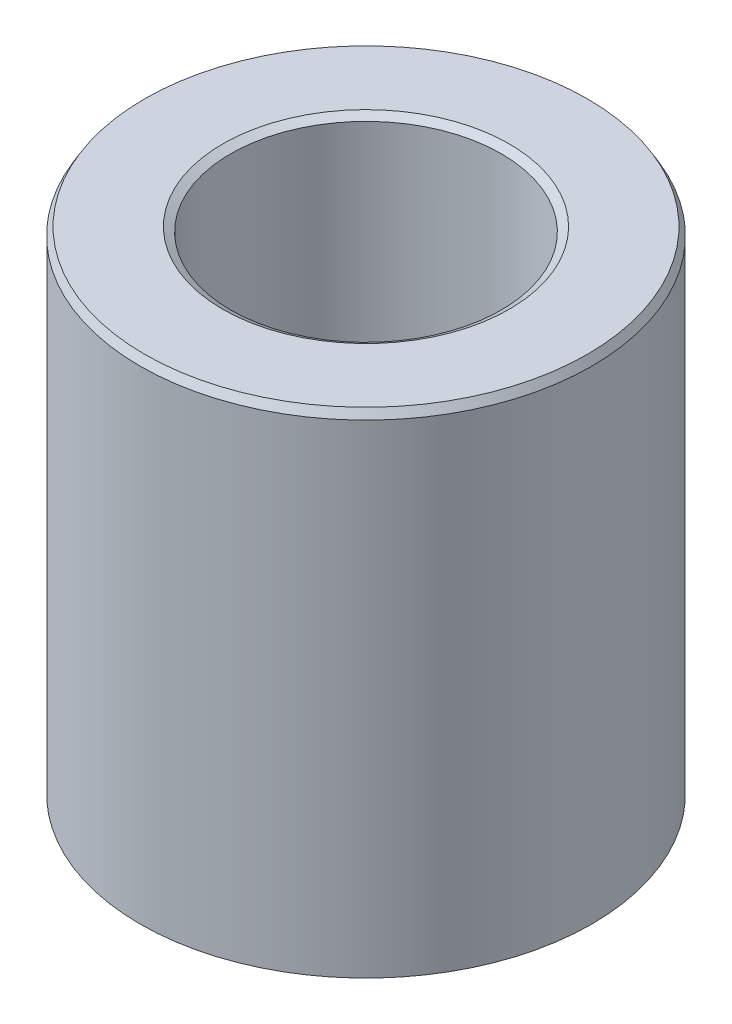
ISO-10303-21;
HEADER;
FILE_DESCRIPTION(('STEP AP214'),'2;1');
FILE_NAME('part.step','',(''),(''),'','','');
FILE_SCHEMA(('AUTOMOTIVE_DESIGN { 1 0 10303 214 1 1 1 1 }'));
ENDSEC;
DATA;
#1=APPLICATION_CONTEXT('core data for automotive mechanical design processes');
#2=APPLICATION_PROTOCOL_DEFINITION('international standard','automotive_design',2000,#1);
#3=PRODUCT_CONTEXT('',#1,'mechanical');
#4=PRODUCT('Part','Part','',(#3));
#5=PRODUCT_RELATED_PRODUCT_CATEGORY('part','',(#4));
#6=PRODUCT_DEFINITION_FORMATION('','',#4);
#7=PRODUCT_DEFINITION_CONTEXT('part definition',#1,'design');
#8=PRODUCT_DEFINITION('design','',#6,#7);
#9=PRODUCT_DEFINITION_SHAPE('','',#8);
#10=(LENGTH_UNIT() NAMED_UNIT(*) SI_UNIT(.MILLI.,.METRE.));
#11=(NAMED_UNIT(*) PLANE_ANGLE_UNIT() SI_UNIT($,.RADIAN.));
#12=(NAMED_UNIT(*) SI_UNIT($,.STERADIAN.) SOLID_ANGLE_UNIT());
#13=UNCERTAINTY_MEASURE_WITH_UNIT(LENGTH_MEASURE(1.E-05),#10,'distance_accuracy_value','');
#14=(GEOMETRIC_REPRESENTATION_CONTEXT(3) GLOBAL_UNCERTAINTY_ASSIGNED_CONTEXT((#13)) GLOBAL_UNIT_ASSIGNED_CONTEXT((#10,
#11,#12)) REPRESENTATION_CONTEXT('',''));
#15=CARTESIAN_POINT('',(0.,0.,0.));
#16=DIRECTION('',(0.,0.,1.));
#17=DIRECTION('',(1.,0.,0.));
#18=AXIS2_PLACEMENT_3D('',#15,#16,#17);
#19=CARTESIAN_POINT('',(0.,120.694779405563,0.));
#20=DIRECTION('',(0.,-1.,0.));
#21=DIRECTION('',(0.,0.,-1.));
#22=AXIS2_PLACEMENT_3D('',#19,#20,#21);
#23=CYLINDRICAL_SURFACE('',#22,55.);
#24=CARTESIAN_POINT('',(0.,1.11331779506904,0.));
#25=DIRECTION('',(0.,1.,0.));
#26=DIRECTION('',(0.,0.,1.));
#27=AXIS2_PLACEMENT_3D('',#24,#25,#26);
#28=CIRCLE('',#27,55.);
#29=CARTESIAN_POINT('',(0.,1.11331779506903,-55.));
#30=VERTEX_POINT('',#29);
#31=EDGE_CURVE('E10',#30,#30,#28,.T.);
#32=CARTESIAN_POINT('',(0.,118.766456419533,0.));
#33=DIRECTION('',(0.,1.,0.));
#34=DIRECTION('',(0.,0.,1.));
#35=AXIS2_PLACEMENT_3D('',#32,#33,#34);
#36=CIRCLE('',#35,55.);
#37=CARTESIAN_POINT('',(0.,118.766456419533,-55.));
#38=VERTEX_POINT('',#37);
#39=EDGE_CURVE('E50',#38,#38,#36,.F.);
#40=CARTESIAN_POINT('',(0.,1.11331779506903,-55.));
#41=CARTESIAN_POINT('',(0.,2.3388713224072,-55.));
#42=CARTESIAN_POINT('',(0.,3.56442484974537,-55.));
#43=CARTESIAN_POINT('',(0.,6.01553190442171,-55.));
#44=CARTESIAN_POINT('',(0.,7.24108543175988,-55.));
#45=CARTESIAN_POINT('',(0.,9.69219248643622,-55.));
#46=CARTESIAN_POINT('',(0.,10.9177460137744,-55.));
#47=CARTESIAN_POINT('',(0.,13.3688530684507,-55.));
#48=CARTESIAN_POINT('',(0.,14.5944065957889,-55.));
#49=CARTESIAN_POINT('',(0.,17.0455136504653,-55.));
#50=CARTESIAN_POINT('',(0.,18.2710671778034,-55.));
#51=CARTESIAN_POINT('',(0.,20.7221742324798,-55.));
#52=CARTESIAN_POINT('',(0.,21.9477277598179,-55.));
#53=CARTESIAN_POINT('',(0.,24.3988348144943,-55.));
#54=CARTESIAN_POINT('',(0.,25.6243883418325,-55.));
#55=CARTESIAN_POINT('',(0.,28.0754953965088,-55.));
#56=CARTESIAN_POINT('',(0.,29.301048923847,-55.));
#57=CARTESIAN_POINT('',(0.,31.7521559785233,-55.));
#58=CARTESIAN_POINT('',(0.,32.9777095058615,-55.));
#59=CARTESIAN_POINT('',(0.,35.4288165605378,-55.));
#60=CARTESIAN_POINT('',(0.,36.654370087876,-55.));
#61=CARTESIAN_POINT('',(0.,39.1054771425523,-55.));
#62=CARTESIAN_POINT('',(0.,40.3310306698905,-55.));
#63=CARTESIAN_POINT('',(0.,42.7821377245668,-55.));
#64=CARTESIAN_POINT('',(0.,44.007691251905,-55.));
#65=CARTESIAN_POINT('',(0.,46.4587983065814,-55.));
#66=CARTESIAN_POINT('',(0.,47.6843518339195,-55.));
#67=CARTESIAN_POINT('',(0.,50.1354588885959,-55.));
#68=CARTESIAN_POINT('',(0.,51.3610124159341,-55.));
#69=CARTESIAN_POINT('',(0.,53.8121194706104,-55.));
#70=CARTESIAN_POINT('',(0.,55.0376729979486,-55.));
#71=CARTESIAN_POINT('',(0.,57.4887800526249,-55.));
#72=CARTESIAN_POINT('',(0.,58.7143335799631,-55.));
#73=CARTESIAN_POINT('',(0.,61.1654406346394,-55.));
#74=CARTESIAN_POINT('',(0.,62.3909941619776,-55.));
#75=CARTESIAN_POINT('',(0.,64.8421012166539,-55.));
#76=CARTESIAN_POINT('',(0.,66.0676547439921,-55.));
#77=CARTESIAN_POINT('',(0.,68.5187617986684,-55.));
#78=CARTESIAN_POINT('',(0.,69.7443153260066,-55.));
#79=CARTESIAN_POINT('',(0.,72.195422380683,-55.));
#80=CARTESIAN_POINT('',(0.,73.4209759080211,-55.));
#81=CARTESIAN_POINT('',(0.,75.8720829626975,-55.));
#82=CARTESIAN_POINT('',(0.,77.0976364900356,-55.));
#83=CARTESIAN_POINT('',(0.,79.548743544712,-55.));
#84=CARTESIAN_POINT('',(0.,80.7742970720501,-55.));
#85=CARTESIAN_POINT('',(0.,83.2254041267265,-55.));
#86=CARTESIAN_POINT('',(0.,84.4509576540647,-55.));
#87=CARTESIAN_POINT('',(0.,86.902064708741,-55.));
#88=CARTESIAN_POINT('',(0.,88.1276182360792,-55.));
#89=CARTESIAN_POINT('',(0.,90.5787252907555,-55.));
#90=CARTESIAN_POINT('',(0.,91.8042788180937,-55.));
#91=CARTESIAN_POINT('',(0.,94.25538587277,-55.));
#92=CARTESIAN_POINT('',(0.,95.4809394001082,-55.));
#93=CARTESIAN_POINT('',(0.,97.9320464547846,-55.));
#94=CARTESIAN_POINT('',(0.,99.1575999821227,-55.));
#95=CARTESIAN_POINT('',(0.,101.608707036799,-55.));
#96=CARTESIAN_POINT('',(0.,102.834260564137,-55.));
#97=CARTESIAN_POINT('',(0.,105.285367618814,-55.));
#98=CARTESIAN_POINT('',(0.,106.510921146152,-55.));
#99=CARTESIAN_POINT('',(0.,108.962028200828,-55.));
#100=CARTESIAN_POINT('',(0.,110.187581728166,-55.));
#101=CARTESIAN_POINT('',(0.,112.638688782843,-55.));
#102=CARTESIAN_POINT('',(0.,113.864242310181,-55.));
#103=CARTESIAN_POINT('',(0.,116.315349364857,-55.));
#104=CARTESIAN_POINT('',(0.,117.540902892195,-55.));
#105=CARTESIAN_POINT('',(0.,118.766456419533,-55.));
#106=B_SPLINE_CURVE_WITH_KNOTS('',3,(#40,#41,#42,#43,#44,#45,#46,#47,#48,#49,#50,#51,#52,#53,
#54,#55,#56,#57,#58,#59,#60,#61,#62,#63,#64,#65,#66,#67,#68,#69,#70,#71,#72,#73,#74,#75,#76,#77,
#78,#79,#80,#81,#82,#83,#84,#85,#86,#87,#88,#89,#90,#91,#92,#93,#94,#95,#96,#97,#98,#99,#100,
#101,#102,#103,#104,#105),.UNSPECIFIED.,.F.,.F.,(4,2,2,2,2,2,2,2,2,2,2,2,2,2,2,2,2,2,2,2,2,2,2,
2,2,2,2,2,2,2,2,2,4),(0.,3.67666058201452,7.35332116402902,11.0299817460435,14.7066423280581,
18.3833029100726,22.0599634920871,25.7366240741016,29.4132846561161,33.0899452381306,
36.7666058201451,40.4432664021596,44.1199269841742,47.7965875661887,51.4732481482032,
55.1499087302177,58.8265693122322,62.5032298942467,66.1798904762612,69.8565510582757,
73.5332116402903,77.2098722223048,80.8865328043193,84.5631933863338,88.2398539683483,
91.9165145503628,95.5931751323774,99.2698357143919,102.946496296406,106.623156878421,
110.299817460435,113.97647804245,117.653138624464),.UNSPECIFIED.);
#107=EDGE_CURVE('BSEAM39',#30,#38,#106,.T.);
#108=ORIENTED_EDGE('',*,*,#31,.T.);
#109=ORIENTED_EDGE('',*,*,#39,.T.);
#110=ORIENTED_EDGE('',*,*,#107,.T.);
#111=ORIENTED_EDGE('',*,*,#107,.F.);
#112=EDGE_LOOP('',(#108,#110,#109,#111));
#113=FACE_BOUND('',#112,.T.);
#114=ADVANCED_FACE('F39',(#113),#23,.T.);
#115=CARTESIAN_POINT('',(0.,120.694779405563,0.));
#116=DIRECTION('',(0.,1.,0.));
#117=DIRECTION('',(0.,0.,1.));
#118=AXIS2_PLACEMENT_3D('',#115,#116,#117);
#119=PLANE('',#118);
#120=CARTESIAN_POINT('',(0.,120.694779405563,0.));
#121=DIRECTION('',(0.,1.,0.));
#122=DIRECTION('',(0.,0.,1.));
#123=AXIS2_PLACEMENT_3D('',#120,#121,#122);
#124=CIRCLE('',#123,34.8838732371338);
#125=CARTESIAN_POINT('',(0.,120.694779405563,34.8838732371338));
#126=VERTEX_POINT('',#125);
#127=EDGE_CURVE('E58',#126,#126,#124,.F.);
#128=ORIENTED_EDGE('',*,*,#127,.T.);
#129=EDGE_LOOP('',(#128));
#130=FACE_BOUND('',#129,.T.);
#131=CARTESIAN_POINT('',(0.,120.694779405563,0.));
#132=DIRECTION('',(0.,1.,0.));
#133=DIRECTION('',(0.,0.,1.));
#134=AXIS2_PLACEMENT_3D('',#131,#132,#133);
#135=CIRCLE('',#134,53.8866822049311);
#136=CARTESIAN_POINT('',(0.,120.694779405563,53.8866822049311));
#137=VERTEX_POINT('',#136);
#138=EDGE_CURVE('E61',#137,#137,#135,.T.);
#139=ORIENTED_EDGE('',*,*,#138,.T.);
#140=EDGE_LOOP('',(#139));
#141=FACE_BOUND('',#140,.T.);
#142=ADVANCED_FACE('F88',(#130,#141),#119,.T.);
#143=CARTESIAN_POINT('',(0.,0.,0.));
#144=DIRECTION('',(0.,1.,0.));
#145=DIRECTION('',(0.,0.,1.));
#146=AXIS2_PLACEMENT_3D('',#143,#144,#145);
#147=PLANE('',#146);
#148=CARTESIAN_POINT('',(0.,0.,0.));
#149=DIRECTION('',(0.,1.,0.));
#150=DIRECTION('',(0.,0.,1.));
#151=AXIS2_PLACEMENT_3D('',#148,#149,#150);
#152=CIRCLE('',#151,34.0688680461726);
#153=CARTESIAN_POINT('',(0.,0.,34.0688680461726));
#154=VERTEX_POINT('',#153);
#155=EDGE_CURVE('E51',#154,#154,#152,.T.);
#156=ORIENTED_EDGE('',*,*,#155,.T.);
#157=EDGE_LOOP('',(#156));
#158=FACE_BOUND('',#157,.T.);
#159=CARTESIAN_POINT('',(0.,0.,0.));
#160=DIRECTION('',(0.,1.,0.));
#161=DIRECTION('',(0.,0.,1.));
#162=AXIS2_PLACEMENT_3D('',#159,#160,#161);
#163=CIRCLE('',#162,53.0716770139698);
#164=CARTESIAN_POINT('',(0.,0.,53.0716770139698));
#165=VERTEX_POINT('',#164);
#166=EDGE_CURVE('E54',#165,#165,#163,.F.);
#167=ORIENTED_EDGE('',*,*,#166,.T.);
#168=EDGE_LOOP('',(#167));
#169=FACE_BOUND('',#168,.T.);
#170=ADVANCED_FACE('F83',(#158,#169),#147,.F.);
#171=CARTESIAN_POINT('',(0.,120.694779405563,0.));
#172=DIRECTION('',(0.,-1.,0.));
#173=DIRECTION('',(0.,0.,-1.));
#174=AXIS2_PLACEMENT_3D('',#171,#172,#173);
#175=CYLINDRICAL_SURFACE('',#174,32.9555502511036);
#176=CARTESIAN_POINT('',(0.,119.581461610494,0.));
#177=DIRECTION('',(0.,1.,0.));
#178=DIRECTION('',(0.,0.,1.));
#179=AXIS2_PLACEMENT_3D('',#176,#177,#178);
#180=CIRCLE('',#179,32.9555502511036);
#181=CARTESIAN_POINT('',(0.,119.581461610494,-32.9555502511036));
#182=VERTEX_POINT('',#181);
#183=EDGE_CURVE('E67',#182,#182,#180,.T.);
#184=CARTESIAN_POINT('',(0.,1.92832298603005,0.));
#185=DIRECTION('',(0.,1.,0.));
#186=DIRECTION('',(0.,0.,1.));
#187=AXIS2_PLACEMENT_3D('',#184,#185,#186);
#188=CIRCLE('',#187,32.9555502511036);
#189=CARTESIAN_POINT('',(0.,1.92832298603003,-32.9555502511036));
#190=VERTEX_POINT('',#189);
#191=EDGE_CURVE('E69',#190,#190,#188,.F.);
#192=CARTESIAN_POINT('',(0.,119.581461610494,-32.9555502511036));
#193=CARTESIAN_POINT('',(0.,118.355908083156,-32.9555502511036));
#194=CARTESIAN_POINT('',(0.,117.130354555818,-32.9555502511036));
#195=CARTESIAN_POINT('',(0.,114.679247501142,-32.9555502511036));
#196=CARTESIAN_POINT('',(0.,113.453693973803,-32.9555502511036));
#197=CARTESIAN_POINT('',(0.,111.002586919127,-32.9555502511036));
#198=CARTESIAN_POINT('',(0.,109.777033391789,-32.9555502511036));
#199=CARTESIAN_POINT('',(0.,107.325926337113,-32.9555502511036));
#200=CARTESIAN_POINT('',(0.,106.100372809774,-32.9555502511036));
#201=CARTESIAN_POINT('',(0.,103.649265755098,-32.9555502511036));
#202=CARTESIAN_POINT('',(0.,102.42371222776,-32.9555502511036));
#203=CARTESIAN_POINT('',(0.,99.9726051730836,-32.9555502511036));
#204=CARTESIAN_POINT('',(0.,98.7470516457454,-32.9555502511036));
#205=CARTESIAN_POINT('',(0.,96.2959445910691,-32.9555502511036));
#206=CARTESIAN_POINT('',(0.,95.0703910637309,-32.9555502511036));
#207=CARTESIAN_POINT('',(0.,92.6192840090546,-32.9555502511036));
#208=CARTESIAN_POINT('',(0.,91.3937304817164,-32.9555502511036));
#209=CARTESIAN_POINT('',(0.,88.9426234270401,-32.9555502511036));
#210=CARTESIAN_POINT('',(0.,87.7170698997019,-32.9555502511036));
#211=CARTESIAN_POINT('',(0.,85.2659628450256,-32.9555502511036));
#212=CARTESIAN_POINT('',(0.,84.0404093176874,-32.9555502511036));
#213=CARTESIAN_POINT('',(0.,81.5893022630111,-32.9555502511036));
#214=CARTESIAN_POINT('',(0.,80.3637487356729,-32.9555502511036));
#215=CARTESIAN_POINT('',(0.,77.9126416809966,-32.9555502511036));
#216=CARTESIAN_POINT('',(0.,76.6870881536584,-32.9555502511036));
#217=CARTESIAN_POINT('',(0.,74.235981098982,-32.9555502511036));
#218=CARTESIAN_POINT('',(0.,73.0104275716439,-32.9555502511036));
#219=CARTESIAN_POINT('',(0.,70.5593205169675,-32.9555502511036));
#220=CARTESIAN_POINT('',(0.,69.3337669896294,-32.9555502511036));
#221=CARTESIAN_POINT('',(0.,66.882659934953,-32.9555502511036));
#222=CARTESIAN_POINT('',(0.,65.6571064076148,-32.9555502511036));
#223=CARTESIAN_POINT('',(0.,63.2059993529385,-32.9555502511036));
#224=CARTESIAN_POINT('',(0.,61.9804458256003,-32.9555502511036));
#225=CARTESIAN_POINT('',(0.,59.529338770924,-32.9555502511036));
#226=CARTESIAN_POINT('',(0.,58.3037852435858,-32.9555502511036));
#227=CARTESIAN_POINT('',(0.,55.8526781889095,-32.9555502511036));
#228=CARTESIAN_POINT('',(0.,54.6271246615713,-32.9555502511036));
#229=CARTESIAN_POINT('',(0.,52.176017606895,-32.9555502511036));
#230=CARTESIAN_POINT('',(0.,50.9504640795568,-32.9555502511036));
#231=CARTESIAN_POINT('',(0.,48.4993570248805,-32.9555502511036));
#232=CARTESIAN_POINT('',(0.,47.2738034975423,-32.9555502511036));
#233=CARTESIAN_POINT('',(0.,44.822696442866,-32.9555502511036));
#234=CARTESIAN_POINT('',(0.,43.5971429155278,-32.9555502511036));
#235=CARTESIAN_POINT('',(0.,41.1460358608515,-32.9555502511036));
#236=CARTESIAN_POINT('',(0.,39.9204823335133,-32.9555502511036));
#237=CARTESIAN_POINT('',(0.,37.4693752788369,-32.9555502511036));
#238=CARTESIAN_POINT('',(0.,36.2438217514988,-32.9555502511036));
#239=CARTESIAN_POINT('',(0.,33.7927146968224,-32.9555502511036));
#240=CARTESIAN_POINT('',(0.,32.5671611694843,-32.9555502511036));
#241=CARTESIAN_POINT('',(0.,30.1160541148079,-32.9555502511036));
#242=CARTESIAN_POINT('',(0.,28.8905005874698,-32.9555502511036));
#243=CARTESIAN_POINT('',(0.,26.4393935327934,-32.9555502511036));
#244=CARTESIAN_POINT('',(0.,25.2138400054553,-32.9555502511036));
#245=CARTESIAN_POINT('',(0.,22.7627329507789,-32.9555502511036));
#246=CARTESIAN_POINT('',(0.,21.5371794234407,-32.9555502511036));
#247=CARTESIAN_POINT('',(0.,19.0860723687644,-32.9555502511036));
#248=CARTESIAN_POINT('',(0.,17.8605188414262,-32.9555502511036));
#249=CARTESIAN_POINT('',(0.,15.4094117867499,-32.9555502511036));
#250=CARTESIAN_POINT('',(0.,14.1838582594117,-32.9555502511036));
#251=CARTESIAN_POINT('',(0.,11.7327512047354,-32.9555502511036));
#252=CARTESIAN_POINT('',(0.,10.5071976773972,-32.9555502511036));
#253=CARTESIAN_POINT('',(0.,8.05609062272088,-32.9555502511036));
#254=CARTESIAN_POINT('',(0.,6.83053709538271,-32.9555502511036));
#255=CARTESIAN_POINT('',(0.,4.37943004070637,-32.9555502511036));
#256=CARTESIAN_POINT('',(0.,3.1538765133682,-32.9555502511036));
#257=CARTESIAN_POINT('',(0.,1.92832298603003,-32.9555502511036));
#258=B_SPLINE_CURVE_WITH_KNOTS('',3,(#192,#193,#194,#195,#196,#197,#198,#199,#200,#201,#202,
#203,#204,#205,#206,#207,#208,#209,#210,#211,#212,#213,#214,#215,#216,#217,#218,#219,#220,#221,
#222,#223,#224,#225,#226,#227,#228,#229,#230,#231,#232,#233,#234,#235,#236,#237,#238,#239,#240,
#241,#242,#243,#244,#245,#246,#247,#248,#249,#250,#251,#252,#253,#254,#255,#256,#257),
.UNSPECIFIED.,.F.,.F.,(4,2,2,2,2,2,2,2,2,2,2,2,2,2,2,2,2,2,2,2,2,2,2,2,2,2,2,2,2,2,2,2,4),(0.,
3.6766605820145,7.35332116402901,11.0299817460435,14.706642328058,18.3833029100725,
22.059963492087,25.7366240741016,29.4132846561161,33.0899452381306,36.7666058201451,
40.4432664021596,44.1199269841741,47.7965875661886,51.4732481482031,55.1499087302176,
58.8265693122321,62.5032298942466,66.1798904762611,69.8565510582757,73.5332116402902,
77.2098722223047,80.8865328043192,84.5631933863337,88.2398539683482,91.9165145503627,
95.5931751323772,99.2698357143917,102.946496296406,106.623156878421,110.299817460435,
113.97647804245,117.653138624464),.UNSPECIFIED.);
#259=EDGE_CURVE('BSEAM71',#182,#190,#258,.T.);
#260=ORIENTED_EDGE('',*,*,#183,.T.);
#261=ORIENTED_EDGE('',*,*,#191,.T.);
#262=ORIENTED_EDGE('',*,*,#259,.T.);
#263=ORIENTED_EDGE('',*,*,#259,.F.);
#264=EDGE_LOOP('',(#260,#262,#261,#263));
#265=FACE_BOUND('',#264,.T.);
#266=ADVANCED_FACE('F71',(#265),#175,.F.);
#267=CARTESIAN_POINT('',(0.,119.581461610494,0.));
#268=DIRECTION('',(0.,1.,0.));
#269=DIRECTION('',(0.,0.,1.));
#270=AXIS2_PLACEMENT_3D('',#267,#268,#269);
#271=CONICAL_SURFACE('',#270,32.9555502511036,1.0471975511966);
#272=ORIENTED_EDGE('',*,*,#127,.F.);
#273=EDGE_LOOP('',(#272));
#274=FACE_BOUND('',#273,.T.);
#275=ORIENTED_EDGE('',*,*,#183,.F.);
#276=EDGE_LOOP('',(#275));
#277=FACE_BOUND('',#276,.T.);
#278=ADVANCED_FACE('F77',(#274,#277),#271,.F.);
#279=CARTESIAN_POINT('',(0.,0.,0.));
#280=DIRECTION('',(0.,-1.,0.));
#281=DIRECTION('',(0.,0.,-1.));
#282=AXIS2_PLACEMENT_3D('',#279,#280,#281);
#283=CONICAL_SURFACE('',#282,34.0688680461726,0.523598775598294);
#284=ORIENTED_EDGE('',*,*,#191,.F.);
#285=EDGE_LOOP('',(#284));
#286=FACE_BOUND('',#285,.T.);
#287=ORIENTED_EDGE('',*,*,#155,.F.);
#288=EDGE_LOOP('',(#287));
#289=FACE_BOUND('',#288,.T.);
#290=ADVANCED_FACE('F73',(#286,#289),#283,.F.);
#291=CARTESIAN_POINT('',(0.,1.11331779506904,0.));
#292=DIRECTION('',(0.,1.,0.));
#293=DIRECTION('',(0.,0.,1.));
#294=AXIS2_PLACEMENT_3D('',#291,#292,#293);
#295=CONICAL_SURFACE('',#294,55.,1.04719755119661);
#296=ORIENTED_EDGE('',*,*,#166,.F.);
#297=EDGE_LOOP('',(#296));
#298=FACE_BOUND('',#297,.T.);
#299=ORIENTED_EDGE('',*,*,#31,.F.);
#300=EDGE_LOOP('',(#299));
#301=FACE_BOUND('',#300,.T.);
#302=ADVANCED_FACE('F76',(#298,#301),#295,.T.);
#303=CARTESIAN_POINT('',(0.,120.694779405563,0.));
#304=DIRECTION('',(0.,-1.,0.));
#305=DIRECTION('',(0.,0.,-1.));
#306=AXIS2_PLACEMENT_3D('',#303,#304,#305);
#307=CONICAL_SURFACE('',#306,53.8866822049311,0.523598775598293);
#308=ORIENTED_EDGE('',*,*,#39,.F.);
#309=EDGE_LOOP('',(#308));
#310=FACE_BOUND('',#309,.T.);
#311=ORIENTED_EDGE('',*,*,#138,.F.);
#312=EDGE_LOOP('',(#311));
#313=FACE_BOUND('',#312,.T.);
#314=ADVANCED_FACE('F45',(#310,#313),#307,.T.);
#315=CLOSED_SHELL('',(#114,#142,#170,#266,#278,#290,#302,#314));
#316=MANIFOLD_SOLID_BREP('B2',#315);
#317=ADVANCED_BREP_SHAPE_REPRESENTATION('',(#18,#316),#14);
#318=SHAPE_DEFINITION_REPRESENTATION(#9,#317);
ENDSEC;
END-ISO-10303-21;
